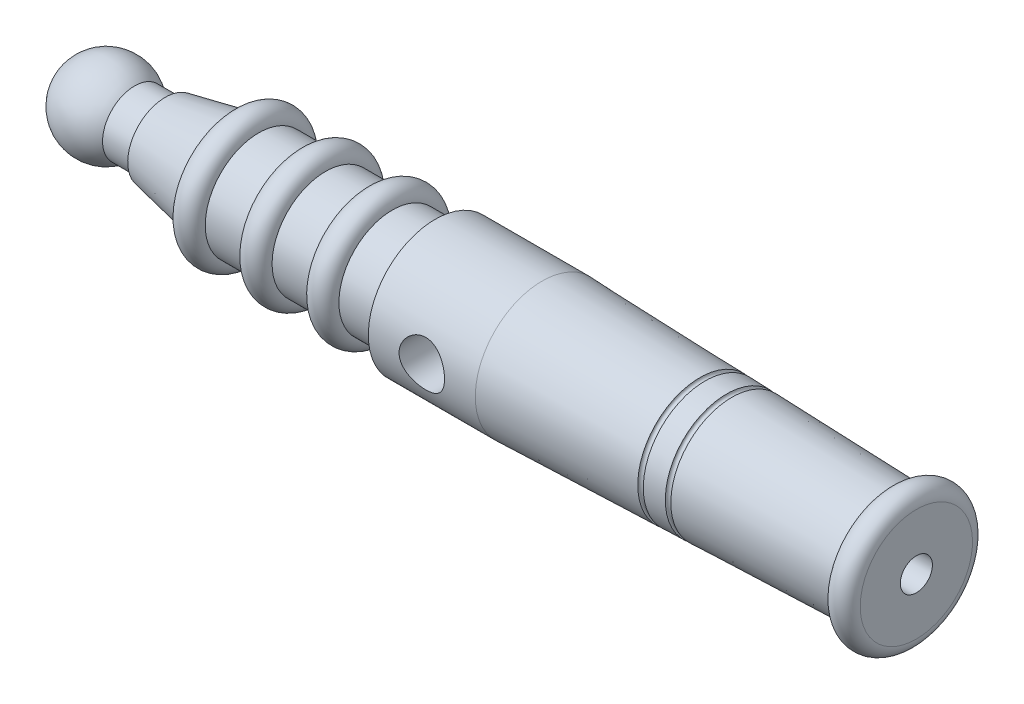
ISO-10303-21;
HEADER;
FILE_DESCRIPTION(('STEP AP214'),'2;1');
FILE_NAME('part.step','',(''),(''),'','','');
FILE_SCHEMA(('AUTOMOTIVE_DESIGN { 1 0 10303 214 1 1 1 1 }'));
ENDSEC;
DATA;
#1=APPLICATION_CONTEXT('core data for automotive mechanical design processes');
#2=APPLICATION_PROTOCOL_DEFINITION('international standard','automotive_design',2000,#1);
#3=PRODUCT_CONTEXT('',#1,'mechanical');
#4=PRODUCT('Part','Part','',(#3));
#5=PRODUCT_RELATED_PRODUCT_CATEGORY('part','',(#4));
#6=PRODUCT_DEFINITION_FORMATION('','',#4);
#7=PRODUCT_DEFINITION_CONTEXT('part definition',#1,'design');
#8=PRODUCT_DEFINITION('design','',#6,#7);
#9=PRODUCT_DEFINITION_SHAPE('','',#8);
#10=(LENGTH_UNIT() NAMED_UNIT(*) SI_UNIT(.MILLI.,.METRE.));
#11=(NAMED_UNIT(*) PLANE_ANGLE_UNIT() SI_UNIT($,.RADIAN.));
#12=(NAMED_UNIT(*) SI_UNIT($,.STERADIAN.) SOLID_ANGLE_UNIT());
#13=UNCERTAINTY_MEASURE_WITH_UNIT(LENGTH_MEASURE(1.E-05),#10,'distance_accuracy_value','');
#14=(GEOMETRIC_REPRESENTATION_CONTEXT(3) GLOBAL_UNCERTAINTY_ASSIGNED_CONTEXT((#13)) GLOBAL_UNIT_ASSIGNED_CONTEXT((#10,
#11,#12)) REPRESENTATION_CONTEXT('',''));
#15=CARTESIAN_POINT('',(0.,0.,0.));
#16=DIRECTION('',(0.,0.,1.));
#17=DIRECTION('',(1.,0.,0.));
#18=AXIS2_PLACEMENT_3D('',#15,#16,#17);
#19=CARTESIAN_POINT('',(8.,0.,0.));
#20=DIRECTION('',(-1.,0.,0.));
#21=DIRECTION('',(0.,1.,0.));
#22=AXIS2_PLACEMENT_3D('',#19,#20,#21);
#23=SPHERICAL_SURFACE('',#22,8.);
#24=CARTESIAN_POINT('',(13.2915026221292,0.,0.));
#25=DIRECTION('',(-1.,0.,0.));
#26=DIRECTION('',(0.,-1.,0.));
#27=AXIS2_PLACEMENT_3D('',#24,#25,#26);
#28=CIRCLE('',#27,6.);
#29=CARTESIAN_POINT('',(13.2915026221292,-6.,0.));
#30=VERTEX_POINT('',#29);
#31=EDGE_CURVE('E10',#30,#30,#28,.T.);
#32=ORIENTED_EDGE('',*,*,#31,.T.);
#33=EDGE_LOOP('',(#32));
#34=FACE_BOUND('',#33,.T.);
#35=ADVANCED_FACE('F37',(#34),#23,.T.);
#36=CARTESIAN_POINT('',(0.,0.,0.));
#37=DIRECTION('',(-1.,0.,0.));
#38=DIRECTION('',(0.,-1.,0.));
#39=AXIS2_PLACEMENT_3D('',#36,#37,#38);
#40=CYLINDRICAL_SURFACE('',#39,6.);
#41=ORIENTED_EDGE('',*,*,#31,.F.);
#42=EDGE_LOOP('',(#41));
#43=FACE_BOUND('',#42,.T.);
#44=CARTESIAN_POINT('',(19.,0.,0.));
#45=DIRECTION('',(-1.,0.,0.));
#46=DIRECTION('',(0.,-1.,0.));
#47=AXIS2_PLACEMENT_3D('',#44,#45,#46);
#48=CIRCLE('',#47,6.);
#49=CARTESIAN_POINT('',(19.,-6.,0.));
#50=VERTEX_POINT('',#49);
#51=EDGE_CURVE('E50',#50,#50,#48,.T.);
#52=ORIENTED_EDGE('',*,*,#51,.T.);
#53=EDGE_LOOP('',(#52));
#54=FACE_BOUND('',#53,.T.);
#55=ADVANCED_FACE('F117',(#43,#54),#40,.T.);
#56=CARTESIAN_POINT('',(19.,7.,0.));
#57=DIRECTION('',(1.,0.,0.));
#58=DIRECTION('',(0.,1.,0.));
#59=AXIS2_PLACEMENT_3D('',#56,#57,#58);
#60=PLANE('',#59);
#61=ORIENTED_EDGE('',*,*,#51,.F.);
#62=EDGE_LOOP('',(#61));
#63=FACE_BOUND('',#62,.T.);
#64=CARTESIAN_POINT('',(19.,0.,0.));
#65=DIRECTION('',(-1.,0.,0.));
#66=DIRECTION('',(0.,-1.,0.));
#67=AXIS2_PLACEMENT_3D('',#64,#65,#66);
#68=CIRCLE('',#67,7.);
#69=CARTESIAN_POINT('',(19.,-7.,0.));
#70=VERTEX_POINT('',#69);
#71=EDGE_CURVE('E56',#70,#70,#68,.T.);
#72=ORIENTED_EDGE('',*,*,#71,.T.);
#73=EDGE_LOOP('',(#72));
#74=FACE_BOUND('',#73,.T.);
#75=ADVANCED_FACE('F121',(#63,#74),#60,.F.);
#76=CARTESIAN_POINT('',(31.5485483107727,0.,0.));
#77=DIRECTION('',(1.,0.,0.));
#78=DIRECTION('',(0.,1.,0.));
#79=AXIS2_PLACEMENT_3D('',#76,#77,#78);
#80=CONICAL_SURFACE('',#79,9.50970966215453,0.19739555984988);
#81=ORIENTED_EDGE('',*,*,#71,.F.);
#82=EDGE_LOOP('',(#81));
#83=FACE_BOUND('',#82,.T.);
#84=CARTESIAN_POINT('',(31.5485483107727,0.,0.));
#85=DIRECTION('',(-1.,0.,0.));
#86=DIRECTION('',(0.,-1.,0.));
#87=AXIS2_PLACEMENT_3D('',#84,#85,#86);
#88=CIRCLE('',#87,9.50970966215453);
#89=CARTESIAN_POINT('',(31.5485483107727,-9.50970966215453,0.));
#90=VERTEX_POINT('',#89);
#91=EDGE_CURVE('E200',#90,#90,#88,.T.);
#92=ORIENTED_EDGE('',*,*,#91,.T.);
#93=EDGE_LOOP('',(#92));
#94=FACE_BOUND('',#93,.T.);
#95=ADVANCED_FACE('F126',(#83,#94),#80,.T.);
#96=CARTESIAN_POINT('',(34.,0.,0.));
#97=DIRECTION('',(-1.,0.,0.));
#98=DIRECTION('',(0.,-1.,0.));
#99=AXIS2_PLACEMENT_3D('',#96,#97,#98);
#100=TOROIDAL_SURFACE('',#99,9.99999999999999,2.5);
#101=ORIENTED_EDGE('',*,*,#91,.F.);
#102=EDGE_LOOP('',(#101));
#103=FACE_BOUND('',#102,.T.);
#104=CARTESIAN_POINT('',(36.5,0.,0.));
#105=DIRECTION('',(-1.,0.,0.));
#106=DIRECTION('',(0.,-1.,0.));
#107=AXIS2_PLACEMENT_3D('',#104,#105,#106);
#108=CIRCLE('',#107,9.99999999999999);
#109=CARTESIAN_POINT('',(36.5,-9.99999999999999,0.));
#110=VERTEX_POINT('',#109);
#111=EDGE_CURVE('E196',#110,#110,#108,.T.);
#112=ORIENTED_EDGE('',*,*,#111,.T.);
#113=EDGE_LOOP('',(#112));
#114=FACE_BOUND('',#113,.T.);
#115=ADVANCED_FACE('F133',(#103,#114),#100,.T.);
#116=CARTESIAN_POINT('',(0.,0.,0.));
#117=DIRECTION('',(-1.,0.,0.));
#118=DIRECTION('',(0.,-1.,0.));
#119=AXIS2_PLACEMENT_3D('',#116,#117,#118);
#120=CYLINDRICAL_SURFACE('',#119,9.99999999999999);
#121=ORIENTED_EDGE('',*,*,#111,.F.);
#122=EDGE_LOOP('',(#121));
#123=FACE_BOUND('',#122,.T.);
#124=CARTESIAN_POINT('',(44.,0.,0.));
#125=DIRECTION('',(-1.,0.,0.));
#126=DIRECTION('',(0.,-1.,0.));
#127=AXIS2_PLACEMENT_3D('',#124,#125,#126);
#128=CIRCLE('',#127,9.99999999999999);
#129=CARTESIAN_POINT('',(44.,-9.99999999999999,0.));
#130=VERTEX_POINT('',#129);
#131=EDGE_CURVE('E192',#130,#130,#128,.T.);
#132=ORIENTED_EDGE('',*,*,#131,.T.);
#133=EDGE_LOOP('',(#132));
#134=FACE_BOUND('',#133,.T.);
#135=ADVANCED_FACE('F137',(#123,#134),#120,.T.);
#136=CARTESIAN_POINT('',(46.5,0.,0.));
#137=DIRECTION('',(-1.,0.,0.));
#138=DIRECTION('',(0.,-1.,0.));
#139=AXIS2_PLACEMENT_3D('',#136,#137,#138);
#140=TOROIDAL_SURFACE('',#139,9.99999999999999,2.5);
#141=ORIENTED_EDGE('',*,*,#131,.F.);
#142=EDGE_LOOP('',(#141));
#143=FACE_BOUND('',#142,.T.);
#144=CARTESIAN_POINT('',(49.,0.,0.));
#145=DIRECTION('',(-1.,0.,0.));
#146=DIRECTION('',(0.,-1.,0.));
#147=AXIS2_PLACEMENT_3D('',#144,#145,#146);
#148=CIRCLE('',#147,10.);
#149=CARTESIAN_POINT('',(49.,-10.,0.));
#150=VERTEX_POINT('',#149);
#151=EDGE_CURVE('E188',#150,#150,#148,.T.);
#152=ORIENTED_EDGE('',*,*,#151,.T.);
#153=EDGE_LOOP('',(#152));
#154=FACE_BOUND('',#153,.T.);
#155=ADVANCED_FACE('F141',(#143,#154),#140,.T.);
#156=CARTESIAN_POINT('',(0.,0.,0.));
#157=DIRECTION('',(-1.,0.,0.));
#158=DIRECTION('',(0.,-1.,0.));
#159=AXIS2_PLACEMENT_3D('',#156,#157,#158);
#160=CYLINDRICAL_SURFACE('',#159,10.);
#161=ORIENTED_EDGE('',*,*,#151,.F.);
#162=EDGE_LOOP('',(#161));
#163=FACE_BOUND('',#162,.T.);
#164=CARTESIAN_POINT('',(56.5,0.,0.));
#165=DIRECTION('',(-1.,0.,0.));
#166=DIRECTION('',(0.,-1.,0.));
#167=AXIS2_PLACEMENT_3D('',#164,#165,#166);
#168=CIRCLE('',#167,10.);
#169=CARTESIAN_POINT('',(56.5,-9.99999999999999,0.));
#170=VERTEX_POINT('',#169);
#171=EDGE_CURVE('E184',#170,#170,#168,.T.);
#172=ORIENTED_EDGE('',*,*,#171,.T.);
#173=EDGE_LOOP('',(#172));
#174=FACE_BOUND('',#173,.T.);
#175=ADVANCED_FACE('F145',(#163,#174),#160,.T.);
#176=CARTESIAN_POINT('',(59.,0.,0.));
#177=DIRECTION('',(-1.,0.,0.));
#178=DIRECTION('',(0.,-1.,0.));
#179=AXIS2_PLACEMENT_3D('',#176,#177,#178);
#180=TOROIDAL_SURFACE('',#179,10.,2.5);
#181=ORIENTED_EDGE('',*,*,#171,.F.);
#182=EDGE_LOOP('',(#181));
#183=FACE_BOUND('',#182,.T.);
#184=CARTESIAN_POINT('',(61.5,0.,0.));
#185=DIRECTION('',(-1.,0.,0.));
#186=DIRECTION('',(0.,-1.,0.));
#187=AXIS2_PLACEMENT_3D('',#184,#185,#186);
#188=CIRCLE('',#187,10.);
#189=CARTESIAN_POINT('',(61.5,-9.99999999999999,0.));
#190=VERTEX_POINT('',#189);
#191=EDGE_CURVE('E174',#190,#190,#188,.T.);
#192=ORIENTED_EDGE('',*,*,#191,.T.);
#193=EDGE_LOOP('',(#192));
#194=FACE_BOUND('',#193,.T.);
#195=ADVANCED_FACE('F149',(#183,#194),#180,.T.);
#196=CARTESIAN_POINT('',(0.,0.,0.));
#197=DIRECTION('',(-1.,0.,0.));
#198=DIRECTION('',(0.,-1.,0.));
#199=AXIS2_PLACEMENT_3D('',#196,#197,#198);
#200=CYLINDRICAL_SURFACE('',#199,10.);
#201=ORIENTED_EDGE('',*,*,#191,.F.);
#202=EDGE_LOOP('',(#201));
#203=FACE_BOUND('',#202,.T.);
#204=CARTESIAN_POINT('',(69.5,0.,0.));
#205=DIRECTION('',(-1.,0.,0.));
#206=DIRECTION('',(0.,-1.,0.));
#207=AXIS2_PLACEMENT_3D('',#204,#205,#206);
#208=CIRCLE('',#207,10.);
#209=CARTESIAN_POINT('',(69.5,-9.99999999999999,0.));
#210=VERTEX_POINT('',#209);
#211=EDGE_CURVE('E164',#210,#210,#208,.T.);
#212=ORIENTED_EDGE('',*,*,#211,.T.);
#213=EDGE_LOOP('',(#212));
#214=FACE_BOUND('',#213,.T.);
#215=ADVANCED_FACE('F153',(#203,#214),#200,.T.);
#216=CARTESIAN_POINT('',(69.5,12.5,0.));
#217=DIRECTION('',(1.,0.,0.));
#218=DIRECTION('',(0.,1.,0.));
#219=AXIS2_PLACEMENT_3D('',#216,#217,#218);
#220=PLANE('',#219);
#221=ORIENTED_EDGE('',*,*,#211,.F.);
#222=EDGE_LOOP('',(#221));
#223=FACE_BOUND('',#222,.T.);
#224=CARTESIAN_POINT('',(69.5,0.,0.));
#225=DIRECTION('',(-1.,0.,0.));
#226=DIRECTION('',(0.,-1.,0.));
#227=AXIS2_PLACEMENT_3D('',#224,#225,#226);
#228=CIRCLE('',#227,12.5);
#229=CARTESIAN_POINT('',(69.5,-12.5,0.));
#230=VERTEX_POINT('',#229);
#231=EDGE_CURVE('E167',#230,#230,#228,.T.);
#232=ORIENTED_EDGE('',*,*,#231,.T.);
#233=EDGE_LOOP('',(#232));
#234=FACE_BOUND('',#233,.T.);
#235=ADVANCED_FACE('F112',(#223,#234),#220,.F.);
#236=CARTESIAN_POINT('',(0.,0.,0.));
#237=DIRECTION('',(-1.,0.,0.));
#238=DIRECTION('',(0.,-1.,0.));
#239=AXIS2_PLACEMENT_3D('',#236,#237,#238);
#240=CYLINDRICAL_SURFACE('',#239,12.5);
#241=CARTESIAN_POINT('',(83.75,0.,-12.5));
#242=CARTESIAN_POINT('',(83.7500020330341,0.231629316585798,-12.5000013493631));
#243=CARTESIAN_POINT('',(83.7310026670462,0.463244602260158,-12.493502868787));
#244=CARTESIAN_POINT('',(83.6557510509299,0.919637198733395,-12.4682205879803));
#245=CARTESIAN_POINT('',(83.5994964112488,1.14441406994913,-12.4494359997198));
#246=CARTESIAN_POINT('',(83.4518965380055,1.58048439723265,-12.4016188733298));
#247=CARTESIAN_POINT('',(83.360611378287,1.79180021823002,-12.3726038861914));
#248=CARTESIAN_POINT('',(83.1458184811844,2.19612038998741,-12.3072763657775));
#249=CARTESIAN_POINT('',(83.0223039931499,2.38912089291744,-12.270962304028));
#250=CARTESIAN_POINT('',(82.7419106918981,2.75825261944735,-12.1933910285169));
#251=CARTESIAN_POINT('',(82.5840824421219,2.93363688121843,-12.1520119725704));
#252=CARTESIAN_POINT('',(82.2415597009182,3.25602333800847,-12.069633438027));
#253=CARTESIAN_POINT('',(82.0568589860642,3.40301894005995,-12.0286340497037));
#254=CARTESIAN_POINT('',(81.6590227206061,3.66879190776175,-11.9503048632061));
#255=CARTESIAN_POINT('',(81.4451980705236,3.78658554363525,-11.9131228611846));
#256=CARTESIAN_POINT('',(80.9993053393739,3.98421855180599,-11.8484975327096));
#257=CARTESIAN_POINT('',(80.7672431109649,4.06407004270031,-11.8210510974587));
#258=CARTESIAN_POINT('',(80.2999754672721,4.180727158555,-11.7802904138908));
#259=CARTESIAN_POINT('',(80.0651618601511,4.21893677153849,-11.7665167255043));
#260=CARTESIAN_POINT('',(79.5920834933359,4.2556150496915,-11.7533040945085));
#261=CARTESIAN_POINT('',(79.3538198766629,4.25409658909984,-11.7538605081));
#262=CARTESIAN_POINT('',(78.8927050541706,4.21244934024964,-11.7688435667819));
#263=CARTESIAN_POINT('',(78.6696614961546,4.1741694203804,-11.7826060062583));
#264=CARTESIAN_POINT('',(78.233374512476,4.06310816523945,-11.8213609901718));
#265=CARTESIAN_POINT('',(78.0201323083421,3.99032254229153,-11.8463549302142));
#266=CARTESIAN_POINT('',(77.6053676287839,3.81113653039609,-11.9052184288415));
#267=CARTESIAN_POINT('',(77.4040979714414,3.70419900732798,-11.9392282253861));
#268=CARTESIAN_POINT('',(77.0217829261274,3.46011773998614,-12.0122344758094));
#269=CARTESIAN_POINT('',(76.8407435911989,3.32296499140251,-12.0512324147271));
#270=CARTESIAN_POINT('',(76.493661489716,3.01353124215082,-12.1324166416207));
#271=CARTESIAN_POINT('',(76.3289723564576,2.83974395035441,-12.1746609041245));
#272=CARTESIAN_POINT('',(76.0307146722549,2.46650176991709,-12.2557250188891));
#273=CARTESIAN_POINT('',(75.897149352277,2.26704421977734,-12.294544515365));
#274=CARTESIAN_POINT('',(75.6637817200249,1.84516436753421,-12.3649312356261));
#275=CARTESIAN_POINT('',(75.5643554382243,1.62251944687187,-12.3964165316577));
#276=CARTESIAN_POINT('',(75.4047926289126,1.16233553494295,-12.4479909440337));
#277=CARTESIAN_POINT('',(75.3446418774178,0.924801969927401,-12.4680841857644));
#278=CARTESIAN_POINT('',(75.2677666520223,0.453032806948607,-12.4939206883818));
#279=CARTESIAN_POINT('',(75.2492140835185,0.219127772365222,-12.5002675966187));
#280=CARTESIAN_POINT('',(75.2508366933351,-0.248508234272231,-12.499715139365));
#281=CARTESIAN_POINT('',(75.2710050341146,-0.482239229767978,-12.4928181125577));
#282=CARTESIAN_POINT('',(75.3480582339634,-0.935487055917019,-12.4669514589193));
#283=CARTESIAN_POINT('',(75.4038095457653,-1.15521999196989,-12.4483547937561));
#284=CARTESIAN_POINT('',(75.549017457826,-1.58211571473706,-12.4013331971436));
#285=CARTESIAN_POINT('',(75.638478386259,-1.78927688332144,-12.3729070036624));
#286=CARTESIAN_POINT('',(75.8512234537794,-2.19135854363444,-12.3081499547371));
#287=CARTESIAN_POINT('',(75.975351890635,-2.38580051143911,-12.2716272117682));
#288=CARTESIAN_POINT('',(76.2529228847875,-2.75168306551547,-12.1948041286534));
#289=CARTESIAN_POINT('',(76.4063747105205,-2.92311635003781,-12.1545025961777));
#290=CARTESIAN_POINT('',(76.7468275664985,-3.24657351287904,-12.0722386132383));
#291=CARTESIAN_POINT('',(76.935073487899,-3.39729328842665,-12.0302879182072));
#292=CARTESIAN_POINT('',(77.3350778779993,-3.66518020873975,-11.9514023496921));
#293=CARTESIAN_POINT('',(77.5468367741812,-3.78234674334563,-11.914467567428));
#294=CARTESIAN_POINT('',(77.9881566802981,-3.97933669538634,-11.8501336294714));
#295=CARTESIAN_POINT('',(78.217694646285,-4.05920753889126,-11.8227223748612));
#296=CARTESIAN_POINT('',(78.6881175672848,-4.1787762904475,-11.7809981443993));
#297=CARTESIAN_POINT('',(78.9289970776366,-4.21849327320324,-11.7666789496003));
#298=CARTESIAN_POINT('',(79.4014252701727,-4.2551029021973,-11.7534862510052));
#299=CARTESIAN_POINT('',(79.632785450644,-4.2541688433069,-11.7538288765012));
#300=CARTESIAN_POINT('',(80.0918665676404,-4.21488538095235,-11.7679720866019));
#301=CARTESIAN_POINT('',(80.3195877368765,-4.17653837981658,-11.781771807111));
#302=CARTESIAN_POINT('',(80.7602486699102,-4.06508169516975,-11.8206793925214));
#303=CARTESIAN_POINT('',(80.9733961386628,-3.99270334550052,-11.8455487968498));
#304=CARTESIAN_POINT('',(81.3846811689962,-3.81583792726955,-11.9036971533386));
#305=CARTESIAN_POINT('',(81.5828153034268,-3.71134355482287,-11.9369780181425));
#306=CARTESIAN_POINT('',(81.9681337048613,-3.46772073523882,-12.0100690469571));
#307=CARTESIAN_POINT('',(82.1544218744554,-3.32724348872326,-12.0501058971147));
#308=CARTESIAN_POINT('',(82.5014819910172,-3.0178925601542,-12.1312763731794));
#309=CARTESIAN_POINT('',(82.6622465618761,-2.84901069833454,-12.1724103121393));
#310=CARTESIAN_POINT('',(82.9603796450803,-2.47930158792251,-12.2531734329683));
#311=CARTESIAN_POINT('',(83.0965125530158,-2.2774454476222,-12.2926709568964));
#312=CARTESIAN_POINT('',(83.3327805226005,-1.85239769842136,-12.3638575017702));
#313=CARTESIAN_POINT('',(83.4329230670564,-1.62921053671336,-12.3955481454237));
#314=CARTESIAN_POINT('',(83.5911995465962,-1.1749855410373,-12.4466848305204));
#315=CARTESIAN_POINT('',(83.6505523489214,-0.944413374480448,-12.4664836857426));
#316=CARTESIAN_POINT('',(83.7299455427374,-0.47588768924404,-12.4931386057906));
#317=CARTESIAN_POINT('',(83.7499979116076,-0.237936441911583,-12.4999986138946));
#318=CARTESIAN_POINT('',(83.75,0.,-12.5));
#319=B_SPLINE_CURVE_WITH_KNOTS('',3,(#241,#242,#243,#244,#245,#246,#247,#248,#249,#250,#251,
#252,#253,#254,#255,#256,#257,#258,#259,#260,#261,#262,#263,#264,#265,#266,#267,#268,#269,#270,
#271,#272,#273,#274,#275,#276,#277,#278,#279,#280,#281,#282,#283,#284,#285,#286,#287,#288,#289,
#290,#291,#292,#293,#294,#295,#296,#297,#298,#299,#300,#301,#302,#303,#304,#305,#306,#307,#308,
#309,#310,#311,#312,#313,#314,#315,#316,#317,#318),.UNSPECIFIED.,.T.,.F.,(4,2,2,2,2,2,2,2,2,2,2,
2,2,2,2,2,2,2,2,2,2,2,2,2,2,2,2,2,2,2,2,2,2,2,2,2,2,2,4),(0.,0.694012031135523,1.38806858050573,
2.08094017307814,2.77395700894338,3.48937549744916,4.2049599350972,4.94210626785766,
5.67901699996316,6.39023024980915,7.10121302747362,7.7782140335303,8.45529918574265,
9.14360628251112,9.83211877686469,10.5581272082641,11.2842109731308,12.0180534127162,
12.7516299370932,13.4522781499046,14.1528026499667,14.8320547208526,15.5113940346079,
16.2089885679879,16.9068039604599,17.6376748123878,18.368558954226,19.0985111385898,
19.8281164030437,20.5187658396099,21.2093709316938,21.8857695188882,22.5623220478608,
23.2693695244284,23.976620961389,24.7129879656022,25.4492017820333,26.1623287080454,
26.8752382644273),.UNSPECIFIED.);
#320=CARTESIAN_POINT('',(83.75,0.,-12.5));
#321=VERTEX_POINT('',#320);
#322=EDGE_CURVE('E40',#321,#321,#319,.T.);
#323=ORIENTED_EDGE('',*,*,#322,.T.);
#324=EDGE_LOOP('',(#323));
#325=FACE_BOUND('',#324,.T.);
#326=CARTESIAN_POINT('',(83.75,0.,12.5));
#327=CARTESIAN_POINT('',(83.7500020330341,-0.231629316585798,12.5000013493631));
#328=CARTESIAN_POINT('',(83.7310026670462,-0.463244602260158,12.493502868787));
#329=CARTESIAN_POINT('',(83.6557510509299,-0.919637198733395,12.4682205879803));
#330=CARTESIAN_POINT('',(83.5994964112488,-1.14441406994913,12.4494359997198));
#331=CARTESIAN_POINT('',(83.4518965380055,-1.58048439723265,12.4016188733298));
#332=CARTESIAN_POINT('',(83.360611378287,-1.79180021823002,12.3726038861914));
#333=CARTESIAN_POINT('',(83.1458184811844,-2.19612038998741,12.3072763657775));
#334=CARTESIAN_POINT('',(83.0223039931499,-2.38912089291744,12.270962304028));
#335=CARTESIAN_POINT('',(82.7419106918981,-2.75825261944735,12.1933910285169));
#336=CARTESIAN_POINT('',(82.5840824421219,-2.93363688121843,12.1520119725704));
#337=CARTESIAN_POINT('',(82.2415597009182,-3.25602333800847,12.069633438027));
#338=CARTESIAN_POINT('',(82.0568589860642,-3.40301894005995,12.0286340497037));
#339=CARTESIAN_POINT('',(81.6590227206061,-3.66879190776175,11.9503048632061));
#340=CARTESIAN_POINT('',(81.4451980705236,-3.78658554363525,11.9131228611846));
#341=CARTESIAN_POINT('',(80.9993053393739,-3.98421855180599,11.8484975327096));
#342=CARTESIAN_POINT('',(80.7672431109649,-4.06407004270031,11.8210510974587));
#343=CARTESIAN_POINT('',(80.2999754672721,-4.180727158555,11.7802904138908));
#344=CARTESIAN_POINT('',(80.0651618601511,-4.21893677153849,11.7665167255043));
#345=CARTESIAN_POINT('',(79.5920834933359,-4.2556150496915,11.7533040945085));
#346=CARTESIAN_POINT('',(79.3538198766629,-4.25409658909984,11.7538605081));
#347=CARTESIAN_POINT('',(78.8927050541706,-4.21244934024964,11.7688435667819));
#348=CARTESIAN_POINT('',(78.6696614961546,-4.1741694203804,11.7826060062583));
#349=CARTESIAN_POINT('',(78.233374512476,-4.06310816523945,11.8213609901718));
#350=CARTESIAN_POINT('',(78.0201323083421,-3.99032254229153,11.8463549302142));
#351=CARTESIAN_POINT('',(77.6053676287839,-3.81113653039609,11.9052184288415));
#352=CARTESIAN_POINT('',(77.4040979714414,-3.70419900732798,11.9392282253861));
#353=CARTESIAN_POINT('',(77.0217829261274,-3.46011773998614,12.0122344758094));
#354=CARTESIAN_POINT('',(76.8407435911989,-3.32296499140251,12.0512324147271));
#355=CARTESIAN_POINT('',(76.493661489716,-3.01353124215082,12.1324166416207));
#356=CARTESIAN_POINT('',(76.3289723564576,-2.83974395035441,12.1746609041245));
#357=CARTESIAN_POINT('',(76.0307146722549,-2.46650176991709,12.2557250188891));
#358=CARTESIAN_POINT('',(75.897149352277,-2.26704421977734,12.294544515365));
#359=CARTESIAN_POINT('',(75.6637817200249,-1.84516436753421,12.3649312356261));
#360=CARTESIAN_POINT('',(75.5643554382243,-1.62251944687187,12.3964165316577));
#361=CARTESIAN_POINT('',(75.4047926289126,-1.16233553494295,12.4479909440337));
#362=CARTESIAN_POINT('',(75.3446418774178,-0.9248019699274,12.4680841857644));
#363=CARTESIAN_POINT('',(75.2677666520223,-0.453032806948606,12.4939206883818));
#364=CARTESIAN_POINT('',(75.2492140835185,-0.219127772365222,12.5002675966187));
#365=CARTESIAN_POINT('',(75.2508366933351,0.248508234272231,12.499715139365));
#366=CARTESIAN_POINT('',(75.2710050341146,0.482239229767979,12.4928181125577));
#367=CARTESIAN_POINT('',(75.3480582339634,0.935487055917021,12.4669514589193));
#368=CARTESIAN_POINT('',(75.4038095457653,1.15521999196989,12.4483547937561));
#369=CARTESIAN_POINT('',(75.549017457826,1.58211571473706,12.4013331971436));
#370=CARTESIAN_POINT('',(75.638478386259,1.78927688332144,12.3729070036624));
#371=CARTESIAN_POINT('',(75.8512234537794,2.19135854363444,12.3081499547371));
#372=CARTESIAN_POINT('',(75.975351890635,2.38580051143911,12.2716272117682));
#373=CARTESIAN_POINT('',(76.2529228847875,2.75168306551547,12.1948041286534));
#374=CARTESIAN_POINT('',(76.4063747105205,2.92311635003781,12.1545025961777));
#375=CARTESIAN_POINT('',(76.7468275664985,3.24657351287904,12.0722386132383));
#376=CARTESIAN_POINT('',(76.935073487899,3.39729328842665,12.0302879182072));
#377=CARTESIAN_POINT('',(77.3350778779993,3.66518020873975,11.9514023496921));
#378=CARTESIAN_POINT('',(77.5468367741812,3.78234674334563,11.914467567428));
#379=CARTESIAN_POINT('',(77.9881566802981,3.97933669538634,11.8501336294714));
#380=CARTESIAN_POINT('',(78.217694646285,4.05920753889126,11.8227223748612));
#381=CARTESIAN_POINT('',(78.6881175672848,4.1787762904475,11.7809981443993));
#382=CARTESIAN_POINT('',(78.9289970776366,4.21849327320324,11.7666789496003));
#383=CARTESIAN_POINT('',(79.4014252701727,4.2551029021973,11.7534862510052));
#384=CARTESIAN_POINT('',(79.632785450644,4.2541688433069,11.7538288765012));
#385=CARTESIAN_POINT('',(80.0918665676404,4.21488538095235,11.7679720866019));
#386=CARTESIAN_POINT('',(80.3195877368765,4.17653837981658,11.781771807111));
#387=CARTESIAN_POINT('',(80.7602486699102,4.06508169516975,11.8206793925214));
#388=CARTESIAN_POINT('',(80.9733961386628,3.99270334550052,11.8455487968498));
#389=CARTESIAN_POINT('',(81.3846811689962,3.81583792726955,11.9036971533386));
#390=CARTESIAN_POINT('',(81.5828153034268,3.71134355482287,11.9369780181425));
#391=CARTESIAN_POINT('',(81.9681337048613,3.46772073523882,12.0100690469571));
#392=CARTESIAN_POINT('',(82.1544218744554,3.32724348872326,12.0501058971147));
#393=CARTESIAN_POINT('',(82.5014819910172,3.0178925601542,12.1312763731794));
#394=CARTESIAN_POINT('',(82.6622465618761,2.84901069833454,12.1724103121393));
#395=CARTESIAN_POINT('',(82.9603796450803,2.47930158792251,12.2531734329683));
#396=CARTESIAN_POINT('',(83.0965125530158,2.2774454476222,12.2926709568964));
#397=CARTESIAN_POINT('',(83.3327805226005,1.85239769842136,12.3638575017702));
#398=CARTESIAN_POINT('',(83.4329230670564,1.62921053671336,12.3955481454237));
#399=CARTESIAN_POINT('',(83.5911995465962,1.1749855410373,12.4466848305204));
#400=CARTESIAN_POINT('',(83.6505523489214,0.944413374480447,12.4664836857426));
#401=CARTESIAN_POINT('',(83.7299455427374,0.47588768924404,12.4931386057906));
#402=CARTESIAN_POINT('',(83.7499979116076,0.237936441911583,12.4999986138946));
#403=CARTESIAN_POINT('',(83.75,0.,12.5));
#404=B_SPLINE_CURVE_WITH_KNOTS('',3,(#326,#327,#328,#329,#330,#331,#332,#333,#334,#335,#336,
#337,#338,#339,#340,#341,#342,#343,#344,#345,#346,#347,#348,#349,#350,#351,#352,#353,#354,#355,
#356,#357,#358,#359,#360,#361,#362,#363,#364,#365,#366,#367,#368,#369,#370,#371,#372,#373,#374,
#375,#376,#377,#378,#379,#380,#381,#382,#383,#384,#385,#386,#387,#388,#389,#390,#391,#392,#393,
#394,#395,#396,#397,#398,#399,#400,#401,#402,#403),.UNSPECIFIED.,.T.,.F.,(4,2,2,2,2,2,2,2,2,2,2,
2,2,2,2,2,2,2,2,2,2,2,2,2,2,2,2,2,2,2,2,2,2,2,2,2,2,2,4),(0.,0.694012031135523,1.38806858050573,
2.08094017307814,2.77395700894338,3.48937549744916,4.2049599350972,4.94210626785766,
5.67901699996316,6.39023024980915,7.10121302747362,7.7782140335303,8.45529918574265,
9.14360628251112,9.83211877686469,10.5581272082641,11.2842109731308,12.0180534127162,
12.7516299370932,13.4522781499046,14.1528026499667,14.8320547208526,15.5113940346079,
16.2089885679879,16.9068039604599,17.6376748123878,18.368558954226,19.0985111385898,
19.8281164030437,20.5187658396099,21.2093709316938,21.8857695188882,22.5623220478608,
23.2693695244284,23.976620961389,24.7129879656022,25.4492017820333,26.1623287080454,
26.8752382644273),.UNSPECIFIED.);
#405=CARTESIAN_POINT('',(83.75,0.,12.5));
#406=VERTEX_POINT('',#405);
#407=EDGE_CURVE('E59',#406,#406,#404,.T.);
#408=ORIENTED_EDGE('',*,*,#407,.T.);
#409=EDGE_LOOP('',(#408));
#410=FACE_BOUND('',#409,.T.);
#411=ORIENTED_EDGE('',*,*,#231,.F.);
#412=EDGE_LOOP('',(#411));
#413=FACE_BOUND('',#412,.T.);
#414=CARTESIAN_POINT('',(89.5,0.,0.));
#415=DIRECTION('',(-1.,0.,0.));
#416=DIRECTION('',(0.,-1.,0.));
#417=AXIS2_PLACEMENT_3D('',#414,#415,#416);
#418=CIRCLE('',#417,12.5);
#419=CARTESIAN_POINT('',(89.5,-12.5,0.));
#420=VERTEX_POINT('',#419);
#421=EDGE_CURVE('E170',#420,#420,#418,.T.);
#422=ORIENTED_EDGE('',*,*,#421,.T.);
#423=EDGE_LOOP('',(#422));
#424=FACE_BOUND('',#423,.T.);
#425=ADVANCED_FACE('F65',(#325,#410,#413,#424),#240,.T.);
#426=CARTESIAN_POINT('',(118.986048203971,0.,0.));
#427=DIRECTION('',(-1.,0.,0.));
#428=DIRECTION('',(0.,-1.,0.));
#429=AXIS2_PLACEMENT_3D('',#426,#427,#428);
#430=CONICAL_SURFACE('',#429,11.5928278481372,0.03075644719545);
#431=ORIENTED_EDGE('',*,*,#421,.F.);
#432=EDGE_LOOP('',(#431));
#433=FACE_BOUND('',#432,.T.);
#434=CARTESIAN_POINT('',(118.986048203971,0.,0.));
#435=DIRECTION('',(-1.,0.,0.));
#436=DIRECTION('',(0.,-1.,0.));
#437=AXIS2_PLACEMENT_3D('',#434,#435,#436);
#438=CIRCLE('',#437,11.5928278481372);
#439=CARTESIAN_POINT('',(118.986048203971,-11.5928278481372,0.));
#440=VERTEX_POINT('',#439);
#441=EDGE_CURVE('E177',#440,#440,#438,.T.);
#442=ORIENTED_EDGE('',*,*,#441,.T.);
#443=EDGE_LOOP('',(#442));
#444=FACE_BOUND('',#443,.T.);
#445=ADVANCED_FACE('F105',(#433,#444),#430,.T.);
#446=CARTESIAN_POINT('',(119.485811732852,0.,0.));
#447=DIRECTION('',(-1.,0.,0.));
#448=DIRECTION('',(0.,-1.,0.));
#449=AXIS2_PLACEMENT_3D('',#446,#447,#448);
#450=TOROIDAL_SURFACE('',#449,11.5774520489531,0.499999999999996);
#451=ORIENTED_EDGE('',*,*,#441,.F.);
#452=EDGE_LOOP('',(#451));
#453=FACE_BOUND('',#452,.T.);
#454=CARTESIAN_POINT('',(119.985575261732,0.,0.));
#455=DIRECTION('',(-1.,0.,0.));
#456=DIRECTION('',(0.,-1.,0.));
#457=AXIS2_PLACEMENT_3D('',#454,#455,#456);
#458=CIRCLE('',#457,11.562076249769);
#459=CARTESIAN_POINT('',(119.985575261732,-11.562076249769,0.));
#460=VERTEX_POINT('',#459);
#461=EDGE_CURVE('E223',#460,#460,#458,.T.);
#462=ORIENTED_EDGE('',*,*,#461,.T.);
#463=EDGE_LOOP('',(#462));
#464=FACE_BOUND('',#463,.T.);
#465=ADVANCED_FACE('F102',(#453,#464),#450,.F.);
#466=CARTESIAN_POINT('',(123.983683492779,0.,0.));
#467=DIRECTION('',(-1.,0.,0.));
#468=DIRECTION('',(0.,-1.,0.));
#469=AXIS2_PLACEMENT_3D('',#466,#467,#468);
#470=CONICAL_SURFACE('',#469,11.4390698562961,0.0307564471954497);
#471=ORIENTED_EDGE('',*,*,#461,.F.);
#472=EDGE_LOOP('',(#471));
#473=FACE_BOUND('',#472,.T.);
#474=CARTESIAN_POINT('',(123.983683492779,0.,0.));
#475=DIRECTION('',(-1.,0.,0.));
#476=DIRECTION('',(0.,-1.,0.));
#477=AXIS2_PLACEMENT_3D('',#474,#475,#476);
#478=CIRCLE('',#477,11.4390698562961);
#479=CARTESIAN_POINT('',(123.983683492779,-11.4390698562961,0.));
#480=VERTEX_POINT('',#479);
#481=EDGE_CURVE('E227',#480,#480,#478,.T.);
#482=ORIENTED_EDGE('',*,*,#481,.T.);
#483=EDGE_LOOP('',(#482));
#484=FACE_BOUND('',#483,.T.);
#485=ADVANCED_FACE('F98',(#473,#484),#470,.T.);
#486=CARTESIAN_POINT('',(124.48344702166,0.,0.));
#487=DIRECTION('',(-1.,0.,0.));
#488=DIRECTION('',(0.,-1.,0.));
#489=AXIS2_PLACEMENT_3D('',#486,#487,#488);
#490=TOROIDAL_SURFACE('',#489,11.4236940571119,0.499999999999997);
#491=ORIENTED_EDGE('',*,*,#481,.F.);
#492=EDGE_LOOP('',(#491));
#493=FACE_BOUND('',#492,.T.);
#494=CARTESIAN_POINT('',(124.983210550541,0.,0.));
#495=DIRECTION('',(-1.,0.,0.));
#496=DIRECTION('',(0.,-1.,0.));
#497=AXIS2_PLACEMENT_3D('',#494,#495,#496);
#498=CIRCLE('',#497,11.4083182579278);
#499=CARTESIAN_POINT('',(124.983210550541,-11.4083182579278,0.));
#500=VERTEX_POINT('',#499);
#501=EDGE_CURVE('E231',#500,#500,#498,.T.);
#502=ORIENTED_EDGE('',*,*,#501,.T.);
#503=EDGE_LOOP('',(#502));
#504=FACE_BOUND('',#503,.T.);
#505=ADVANCED_FACE('F94',(#493,#504),#490,.F.);
#506=CARTESIAN_POINT('',(154.5,0.,0.));
#507=DIRECTION('',(-1.,0.,0.));
#508=DIRECTION('',(0.,-1.,0.));
#509=AXIS2_PLACEMENT_3D('',#506,#507,#508);
#510=CONICAL_SURFACE('',#509,10.5002003163265,0.0307564471954499);
#511=ORIENTED_EDGE('',*,*,#501,.F.);
#512=EDGE_LOOP('',(#511));
#513=FACE_BOUND('',#512,.T.);
#514=CARTESIAN_POINT('',(154.5,0.,0.));
#515=DIRECTION('',(-1.,0.,0.));
#516=DIRECTION('',(0.,-1.,0.));
#517=AXIS2_PLACEMENT_3D('',#514,#515,#516);
#518=CIRCLE('',#517,10.5002003163265);
#519=CARTESIAN_POINT('',(154.5,-10.5002003163265,0.));
#520=VERTEX_POINT('',#519);
#521=EDGE_CURVE('E235',#520,#520,#518,.T.);
#522=ORIENTED_EDGE('',*,*,#521,.T.);
#523=EDGE_LOOP('',(#522));
#524=FACE_BOUND('',#523,.T.);
#525=ADVANCED_FACE('F90',(#513,#524),#510,.T.);
#526=CARTESIAN_POINT('',(156.999999991975,0.,0.));
#527=DIRECTION('',(-1.,0.,0.));
#528=DIRECTION('',(0.,-1.,0.));
#529=AXIS2_PLACEMENT_3D('',#526,#527,#528);
#530=TOROIDAL_SURFACE('',#529,10.5000000020063,2.49999999999999);
#531=ORIENTED_EDGE('',*,*,#521,.F.);
#532=EDGE_LOOP('',(#531));
#533=FACE_BOUND('',#532,.T.);
#534=CARTESIAN_POINT('',(159.499999991975,0.,0.));
#535=DIRECTION('',(-1.,0.,0.));
#536=DIRECTION('',(0.,-1.,0.));
#537=AXIS2_PLACEMENT_3D('',#534,#535,#536);
#538=CIRCLE('',#537,10.5000000020063);
#539=CARTESIAN_POINT('',(159.499999991975,-10.5000000020063,0.));
#540=VERTEX_POINT('',#539);
#541=EDGE_CURVE('E239',#540,#540,#538,.T.);
#542=ORIENTED_EDGE('',*,*,#541,.T.);
#543=EDGE_LOOP('',(#542));
#544=FACE_BOUND('',#543,.T.);
#545=ADVANCED_FACE('F86',(#533,#544),#530,.T.);
#546=CARTESIAN_POINT('',(159.499999991975,3.,0.));
#547=DIRECTION('',(-1.,0.,0.));
#548=DIRECTION('',(0.,-1.,0.));
#549=AXIS2_PLACEMENT_3D('',#546,#547,#548);
#550=PLANE('',#549);
#551=ORIENTED_EDGE('',*,*,#541,.F.);
#552=EDGE_LOOP('',(#551));
#553=FACE_BOUND('',#552,.T.);
#554=CARTESIAN_POINT('',(159.499999991975,0.,0.));
#555=DIRECTION('',(-1.,0.,0.));
#556=DIRECTION('',(0.,-1.,0.));
#557=AXIS2_PLACEMENT_3D('',#554,#555,#556);
#558=CIRCLE('',#557,3.);
#559=CARTESIAN_POINT('',(159.499999991975,-2.99999999999999,0.));
#560=VERTEX_POINT('',#559);
#561=EDGE_CURVE('E243',#560,#560,#558,.T.);
#562=ORIENTED_EDGE('',*,*,#561,.T.);
#563=EDGE_LOOP('',(#562));
#564=FACE_BOUND('',#563,.T.);
#565=ADVANCED_FACE('F82',(#553,#564),#550,.F.);
#566=CARTESIAN_POINT('',(0.,0.,0.));
#567=DIRECTION('',(-1.,0.,0.));
#568=DIRECTION('',(0.,-1.,0.));
#569=AXIS2_PLACEMENT_3D('',#566,#567,#568);
#570=CYLINDRICAL_SURFACE('',#569,3.);
#571=ORIENTED_EDGE('',*,*,#561,.F.);
#572=EDGE_LOOP('',(#571));
#573=FACE_BOUND('',#572,.T.);
#574=CARTESIAN_POINT('',(109.499999991975,0.,0.));
#575=DIRECTION('',(-1.,0.,0.));
#576=DIRECTION('',(0.,-1.,0.));
#577=AXIS2_PLACEMENT_3D('',#574,#575,#576);
#578=CIRCLE('',#577,3.);
#579=CARTESIAN_POINT('',(109.499999991975,-3.,0.));
#580=VERTEX_POINT('',#579);
#581=EDGE_CURVE('E247',#580,#580,#578,.T.);
#582=ORIENTED_EDGE('',*,*,#581,.T.);
#583=EDGE_LOOP('',(#582));
#584=FACE_BOUND('',#583,.T.);
#585=ADVANCED_FACE('F78',(#573,#584),#570,.F.);
#586=CARTESIAN_POINT('',(109.499999991975,0.,0.));
#587=DIRECTION('',(-1.,0.,0.));
#588=DIRECTION('',(0.,-1.,0.));
#589=AXIS2_PLACEMENT_3D('',#586,#587,#588);
#590=PLANE('',#589);
#591=ORIENTED_EDGE('',*,*,#581,.F.);
#592=EDGE_LOOP('',(#591));
#593=FACE_BOUND('',#592,.T.);
#594=ADVANCED_FACE('F73',(#593),#590,.F.);
#595=CARTESIAN_POINT('',(79.5,0.,-13.0000000020063));
#596=DIRECTION('',(0.,0.,1.));
#597=DIRECTION('',(1.,0.,0.));
#598=AXIS2_PLACEMENT_3D('',#595,#596,#597);
#599=CYLINDRICAL_SURFACE('',#598,4.25000000000001);
#600=ORIENTED_EDGE('',*,*,#407,.F.);
#601=EDGE_LOOP('',(#600));
#602=FACE_BOUND('',#601,.T.);
#603=ORIENTED_EDGE('',*,*,#322,.F.);
#604=EDGE_LOOP('',(#603));
#605=FACE_BOUND('',#604,.T.);
#606=ADVANCED_FACE('F69',(#602,#605),#599,.F.);
#607=CLOSED_SHELL('',(#35,#55,#75,#95,#115,#135,#155,#175,#195,#215,#235,#425,#445,#465,#485,
#505,#525,#545,#565,#585,#594,#606));
#608=MANIFOLD_SOLID_BREP('B2',#607);
#609=ADVANCED_BREP_SHAPE_REPRESENTATION('',(#18,#608),#14);
#610=SHAPE_DEFINITION_REPRESENTATION(#9,#609);
ENDSEC;
END-ISO-10303-21;
